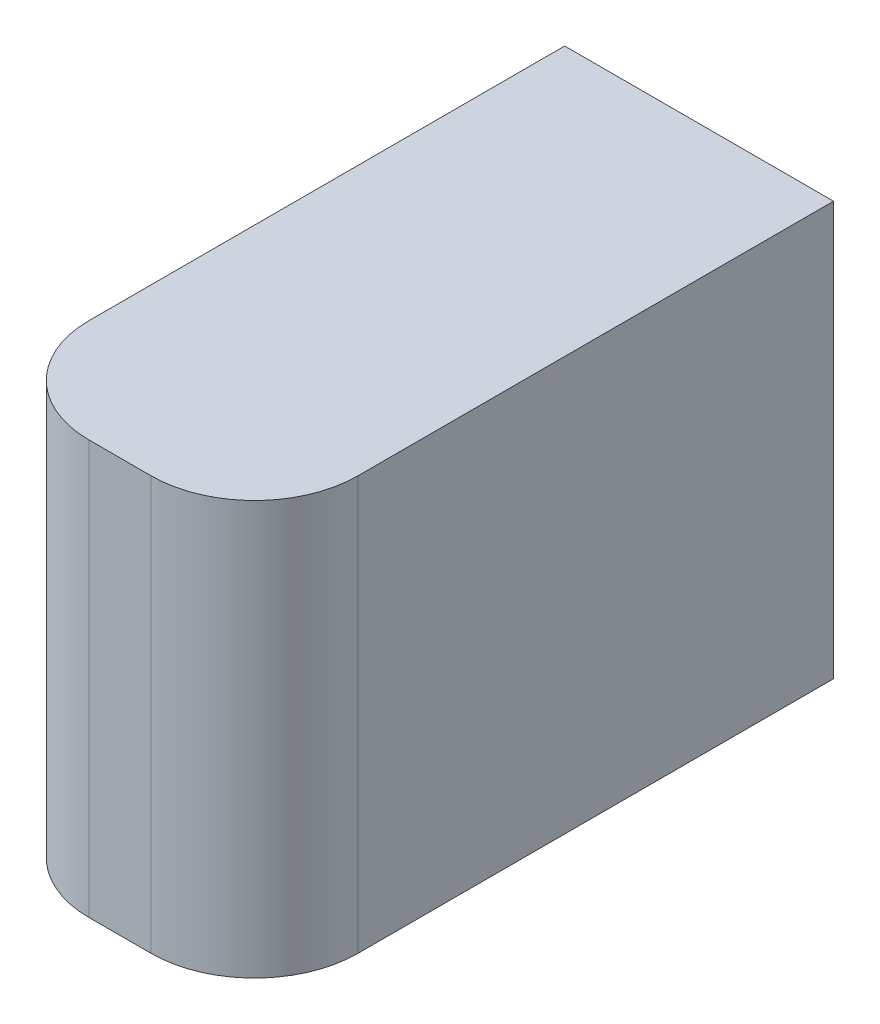
ISO-10303-21;
HEADER;
FILE_DESCRIPTION(('STEP AP214'),'2;1');
FILE_NAME('part.step','',(''),(''),'','','');
FILE_SCHEMA(('AUTOMOTIVE_DESIGN { 1 0 10303 214 1 1 1 1 }'));
ENDSEC;
DATA;
#1=APPLICATION_CONTEXT('core data for automotive mechanical design processes');
#2=APPLICATION_PROTOCOL_DEFINITION('international standard','automotive_design',2000,#1);
#3=PRODUCT_CONTEXT('',#1,'mechanical');
#4=PRODUCT('Part','Part','',(#3));
#5=PRODUCT_RELATED_PRODUCT_CATEGORY('part','',(#4));
#6=PRODUCT_DEFINITION_FORMATION('','',#4);
#7=PRODUCT_DEFINITION_CONTEXT('part definition',#1,'design');
#8=PRODUCT_DEFINITION('design','',#6,#7);
#9=PRODUCT_DEFINITION_SHAPE('','',#8);
#10=(LENGTH_UNIT() NAMED_UNIT(*) SI_UNIT(.MILLI.,.METRE.));
#11=(NAMED_UNIT(*) PLANE_ANGLE_UNIT() SI_UNIT($,.RADIAN.));
#12=(NAMED_UNIT(*) SI_UNIT($,.STERADIAN.) SOLID_ANGLE_UNIT());
#13=UNCERTAINTY_MEASURE_WITH_UNIT(LENGTH_MEASURE(1.E-05),#10,'distance_accuracy_value','');
#14=(GEOMETRIC_REPRESENTATION_CONTEXT(3) GLOBAL_UNCERTAINTY_ASSIGNED_CONTEXT((#13)) GLOBAL_UNIT_ASSIGNED_CONTEXT((#10,
#11,#12)) REPRESENTATION_CONTEXT('',''));
#15=CARTESIAN_POINT('',(0.,0.,0.));
#16=DIRECTION('',(0.,0.,1.));
#17=DIRECTION('',(1.,0.,0.));
#18=AXIS2_PLACEMENT_3D('',#15,#16,#17);
#19=CARTESIAN_POINT('',(-1.3,2.,5.6));
#20=DIRECTION('',(1.,0.,0.));
#21=DIRECTION('',(0.,0.,-1.));
#22=AXIS2_PLACEMENT_3D('',#19,#20,#21);
#23=PLANE('',#22);
#24=DIRECTION('',(0.,0.,-1.));
#25=VECTOR('',#24,1.);
#26=CARTESIAN_POINT('',(-1.3,-2.,5.6));
#27=LINE('',#26,#25);
#28=CARTESIAN_POINT('',(-1.3,-2.,4.6));
#29=VERTEX_POINT('',#28);
#30=CARTESIAN_POINT('',(-1.3,-2.,0.));
#31=VERTEX_POINT('',#30);
#32=EDGE_CURVE('E82',#29,#31,#27,.T.);
#33=ORIENTED_EDGE('',*,*,#32,.F.);
#34=DIRECTION('',(0.,-1.,0.));
#35=VECTOR('',#34,1.);
#36=CARTESIAN_POINT('',(-1.3,2.,4.6));
#37=LINE('',#36,#35);
#38=CARTESIAN_POINT('',(-1.3,2.,4.6));
#39=VERTEX_POINT('',#38);
#40=EDGE_CURVE('E11',#29,#39,#37,.F.);
#41=ORIENTED_EDGE('',*,*,#40,.T.);
#42=DIRECTION('',(0.,0.,-1.));
#43=VECTOR('',#42,1.);
#44=CARTESIAN_POINT('',(-1.3,2.,5.6));
#45=LINE('',#44,#43);
#46=CARTESIAN_POINT('',(-1.3,2.,0.));
#47=VERTEX_POINT('',#46);
#48=EDGE_CURVE('E102',#39,#47,#45,.T.);
#49=ORIENTED_EDGE('',*,*,#48,.T.);
#50=DIRECTION('',(0.,-1.,0.));
#51=VECTOR('',#50,1.);
#52=CARTESIAN_POINT('',(-1.3,2.,0.));
#53=LINE('',#52,#51);
#54=EDGE_CURVE('E97',#47,#31,#53,.T.);
#55=ORIENTED_EDGE('',*,*,#54,.T.);
#56=EDGE_LOOP('',(#33,#41,#49,#55));
#57=FACE_BOUND('',#56,.T.);
#58=ADVANCED_FACE('F31',(#57),#23,.F.);
#59=CARTESIAN_POINT('',(-1.3,-2.,5.6));
#60=DIRECTION('',(0.,1.,0.));
#61=DIRECTION('',(0.,0.,1.));
#62=AXIS2_PLACEMENT_3D('',#59,#60,#61);
#63=PLANE('',#62);
#64=DIRECTION('',(0.,0.,-1.));
#65=VECTOR('',#64,1.);
#66=CARTESIAN_POINT('',(1.3,-2.,5.6));
#67=LINE('',#66,#65);
#68=CARTESIAN_POINT('',(1.3,-2.,4.6));
#69=VERTEX_POINT('',#68);
#70=CARTESIAN_POINT('',(1.3,-2.,0.));
#71=VERTEX_POINT('',#70);
#72=EDGE_CURVE('E91',#69,#71,#67,.T.);
#73=ORIENTED_EDGE('',*,*,#72,.F.);
#74=CARTESIAN_POINT('',(0.299999999999997,-2.,4.6));
#75=DIRECTION('',(0.,1.,0.));
#76=DIRECTION('',(0.,0.,1.));
#77=AXIS2_PLACEMENT_3D('',#74,#75,#76);
#78=CIRCLE('',#77,1.);
#79=CARTESIAN_POINT('',(0.299999999999997,-2.,5.6));
#80=VERTEX_POINT('',#79);
#81=EDGE_CURVE('E39',#69,#80,#78,.F.);
#82=ORIENTED_EDGE('',*,*,#81,.T.);
#83=DIRECTION('',(1.,0.,0.));
#84=VECTOR('',#83,1.);
#85=CARTESIAN_POINT('',(-1.3,-2.,5.6));
#86=LINE('',#85,#84);
#87=CARTESIAN_POINT('',(-0.3,-2.,5.6));
#88=VERTEX_POINT('',#87);
#89=EDGE_CURVE('E112',#88,#80,#86,.T.);
#90=ORIENTED_EDGE('',*,*,#89,.F.);
#91=CARTESIAN_POINT('',(-0.3,-2.,4.6));
#92=DIRECTION('',(0.,1.,0.));
#93=DIRECTION('',(0.,0.,1.));
#94=AXIS2_PLACEMENT_3D('',#91,#92,#93);
#95=CIRCLE('',#94,1.);
#96=EDGE_CURVE('E46',#88,#29,#95,.F.);
#97=ORIENTED_EDGE('',*,*,#96,.T.);
#98=ORIENTED_EDGE('',*,*,#32,.T.);
#99=DIRECTION('',(1.,0.,0.));
#100=VECTOR('',#99,1.);
#101=CARTESIAN_POINT('',(-1.3,-2.,0.));
#102=LINE('',#101,#100);
#103=EDGE_CURVE('E85',#31,#71,#102,.T.);
#104=ORIENTED_EDGE('',*,*,#103,.T.);
#105=EDGE_LOOP('',(#73,#82,#90,#97,#98,#104));
#106=FACE_BOUND('',#105,.T.);
#107=ADVANCED_FACE('F84',(#106),#63,.F.);
#108=CARTESIAN_POINT('',(1.3,2.,5.6));
#109=DIRECTION('',(-1.,0.,0.));
#110=DIRECTION('',(0.,0.,1.));
#111=AXIS2_PLACEMENT_3D('',#108,#109,#110);
#112=PLANE('',#111);
#113=DIRECTION('',(0.,0.,-1.));
#114=VECTOR('',#113,1.);
#115=CARTESIAN_POINT('',(1.3,2.,5.6));
#116=LINE('',#115,#114);
#117=CARTESIAN_POINT('',(1.3,2.,4.6));
#118=VERTEX_POINT('',#117);
#119=CARTESIAN_POINT('',(1.3,2.,0.));
#120=VERTEX_POINT('',#119);
#121=EDGE_CURVE('E114',#118,#120,#116,.T.);
#122=ORIENTED_EDGE('',*,*,#121,.F.);
#123=DIRECTION('',(0.,1.,0.));
#124=VECTOR('',#123,1.);
#125=CARTESIAN_POINT('',(1.3,-2.,4.6));
#126=LINE('',#125,#124);
#127=EDGE_CURVE('E54',#118,#69,#126,.F.);
#128=ORIENTED_EDGE('',*,*,#127,.T.);
#129=ORIENTED_EDGE('',*,*,#72,.T.);
#130=DIRECTION('',(0.,1.,0.));
#131=VECTOR('',#130,1.);
#132=CARTESIAN_POINT('',(1.3,2.,0.));
#133=LINE('',#132,#131);
#134=EDGE_CURVE('E99',#71,#120,#133,.T.);
#135=ORIENTED_EDGE('',*,*,#134,.T.);
#136=EDGE_LOOP('',(#122,#128,#129,#135));
#137=FACE_BOUND('',#136,.T.);
#138=ADVANCED_FACE('F139',(#137),#112,.F.);
#139=CARTESIAN_POINT('',(-1.3,2.,5.6));
#140=DIRECTION('',(0.,-1.,0.));
#141=DIRECTION('',(0.,0.,-1.));
#142=AXIS2_PLACEMENT_3D('',#139,#140,#141);
#143=PLANE('',#142);
#144=DIRECTION('',(-1.,0.,0.));
#145=VECTOR('',#144,1.);
#146=CARTESIAN_POINT('',(-1.3,2.,5.6));
#147=LINE('',#146,#145);
#148=CARTESIAN_POINT('',(0.299999999999997,2.,5.6));
#149=VERTEX_POINT('',#148);
#150=CARTESIAN_POINT('',(-0.3,2.,5.6));
#151=VERTEX_POINT('',#150);
#152=EDGE_CURVE('E106',#149,#151,#147,.T.);
#153=ORIENTED_EDGE('',*,*,#152,.F.);
#154=CARTESIAN_POINT('',(0.299999999999997,2.,4.6));
#155=DIRECTION('',(0.,-1.,0.));
#156=DIRECTION('',(0.,0.,-1.));
#157=AXIS2_PLACEMENT_3D('',#154,#155,#156);
#158=CIRCLE('',#157,1.);
#159=EDGE_CURVE('E124',#149,#118,#158,.F.);
#160=ORIENTED_EDGE('',*,*,#159,.T.);
#161=ORIENTED_EDGE('',*,*,#121,.T.);
#162=DIRECTION('',(-1.,0.,0.));
#163=VECTOR('',#162,1.);
#164=CARTESIAN_POINT('',(-1.3,2.,0.));
#165=LINE('',#164,#163);
#166=EDGE_CURVE('E110',#120,#47,#165,.T.);
#167=ORIENTED_EDGE('',*,*,#166,.T.);
#168=ORIENTED_EDGE('',*,*,#48,.F.);
#169=CARTESIAN_POINT('',(-0.3,2.,4.6));
#170=DIRECTION('',(0.,-1.,0.));
#171=DIRECTION('',(0.,0.,-1.));
#172=AXIS2_PLACEMENT_3D('',#169,#170,#171);
#173=CIRCLE('',#172,1.);
#174=EDGE_CURVE('E122',#39,#151,#173,.F.);
#175=ORIENTED_EDGE('',*,*,#174,.T.);
#176=EDGE_LOOP('',(#153,#160,#161,#167,#168,#175));
#177=FACE_BOUND('',#176,.T.);
#178=ADVANCED_FACE('F138',(#177),#143,.F.);
#179=CARTESIAN_POINT('',(-1.3,-2.,5.6));
#180=DIRECTION('',(0.,0.,1.));
#181=DIRECTION('',(1.,0.,0.));
#182=AXIS2_PLACEMENT_3D('',#179,#180,#181);
#183=PLANE('',#182);
#184=ORIENTED_EDGE('',*,*,#89,.T.);
#185=DIRECTION('',(0.,1.,0.));
#186=VECTOR('',#185,1.);
#187=CARTESIAN_POINT('',(0.299999999999997,2.,5.6));
#188=LINE('',#187,#186);
#189=EDGE_CURVE('E119',#80,#149,#188,.T.);
#190=ORIENTED_EDGE('',*,*,#189,.T.);
#191=ORIENTED_EDGE('',*,*,#152,.T.);
#192=DIRECTION('',(0.,-1.,0.));
#193=VECTOR('',#192,1.);
#194=CARTESIAN_POINT('',(-0.3,-2.,5.6));
#195=LINE('',#194,#193);
#196=EDGE_CURVE('E90',#151,#88,#195,.T.);
#197=ORIENTED_EDGE('',*,*,#196,.T.);
#198=EDGE_LOOP('',(#184,#190,#191,#197));
#199=FACE_BOUND('',#198,.T.);
#200=ADVANCED_FACE('F132',(#199),#183,.T.);
#201=CARTESIAN_POINT('',(-1.3,-2.,0.));
#202=DIRECTION('',(0.,0.,1.));
#203=DIRECTION('',(1.,0.,0.));
#204=AXIS2_PLACEMENT_3D('',#201,#202,#203);
#205=PLANE('',#204);
#206=ORIENTED_EDGE('',*,*,#54,.F.);
#207=ORIENTED_EDGE('',*,*,#166,.F.);
#208=ORIENTED_EDGE('',*,*,#134,.F.);
#209=ORIENTED_EDGE('',*,*,#103,.F.);
#210=EDGE_LOOP('',(#206,#207,#208,#209));
#211=FACE_BOUND('',#210,.T.);
#212=ADVANCED_FACE('F95',(#211),#205,.F.);
#213=CARTESIAN_POINT('',(0.299999999999997,-2.,4.6));
#214=DIRECTION('',(0.,-1.,0.));
#215=DIRECTION('',(0.,0.,-1.));
#216=AXIS2_PLACEMENT_3D('',#213,#214,#215);
#217=CYLINDRICAL_SURFACE('',#216,1.);
#218=ORIENTED_EDGE('',*,*,#81,.F.);
#219=ORIENTED_EDGE('',*,*,#127,.F.);
#220=ORIENTED_EDGE('',*,*,#159,.F.);
#221=ORIENTED_EDGE('',*,*,#189,.F.);
#222=EDGE_LOOP('',(#218,#219,#220,#221));
#223=FACE_BOUND('',#222,.T.);
#224=ADVANCED_FACE('F136',(#223),#217,.T.);
#225=CARTESIAN_POINT('',(-0.3,-2.,4.6));
#226=DIRECTION('',(0.,1.,0.));
#227=DIRECTION('',(0.,0.,1.));
#228=AXIS2_PLACEMENT_3D('',#225,#226,#227);
#229=CYLINDRICAL_SURFACE('',#228,1.);
#230=ORIENTED_EDGE('',*,*,#174,.F.);
#231=ORIENTED_EDGE('',*,*,#40,.F.);
#232=ORIENTED_EDGE('',*,*,#96,.F.);
#233=ORIENTED_EDGE('',*,*,#196,.F.);
#234=EDGE_LOOP('',(#230,#231,#232,#233));
#235=FACE_BOUND('',#234,.T.);
#236=ADVANCED_FACE('F33',(#235),#229,.T.);
#237=CLOSED_SHELL('',(#58,#107,#138,#178,#200,#212,#224,#236));
#238=MANIFOLD_SOLID_BREP('B2',#237);
#239=ADVANCED_BREP_SHAPE_REPRESENTATION('',(#18,#238),#14);
#240=SHAPE_DEFINITION_REPRESENTATION(#9,#239);
ENDSEC;
END-ISO-10303-21;
